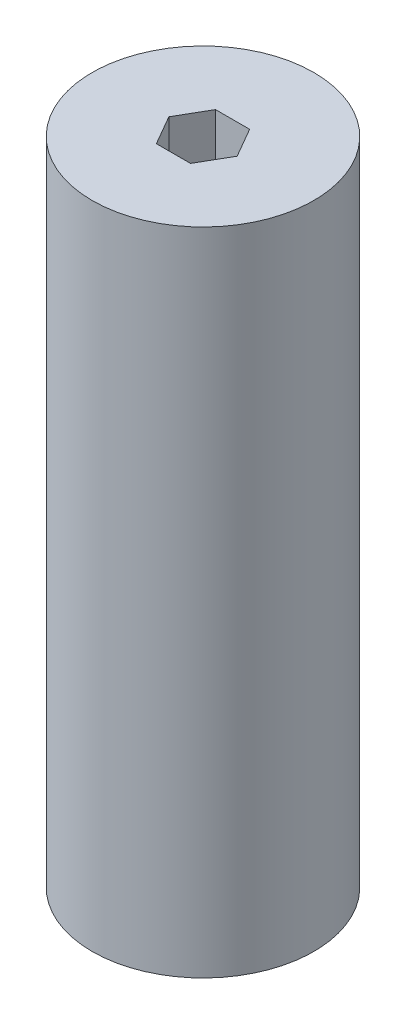
ISO-10303-21;
HEADER;
FILE_DESCRIPTION(('STEP AP214'),'2;1');
FILE_NAME('part.step','',(''),(''),'','','');
FILE_SCHEMA(('AUTOMOTIVE_DESIGN { 1 0 10303 214 1 1 1 1 }'));
ENDSEC;
DATA;
#1=APPLICATION_CONTEXT('core data for automotive mechanical design processes');
#2=APPLICATION_PROTOCOL_DEFINITION('international standard','automotive_design',2000,#1);
#3=PRODUCT_CONTEXT('',#1,'mechanical');
#4=PRODUCT('Part','Part','',(#3));
#5=PRODUCT_RELATED_PRODUCT_CATEGORY('part','',(#4));
#6=PRODUCT_DEFINITION_FORMATION('','',#4);
#7=PRODUCT_DEFINITION_CONTEXT('part definition',#1,'design');
#8=PRODUCT_DEFINITION('design','',#6,#7);
#9=PRODUCT_DEFINITION_SHAPE('','',#8);
#10=(LENGTH_UNIT() NAMED_UNIT(*) SI_UNIT(.MILLI.,.METRE.));
#11=(NAMED_UNIT(*) PLANE_ANGLE_UNIT() SI_UNIT($,.RADIAN.));
#12=(NAMED_UNIT(*) SI_UNIT($,.STERADIAN.) SOLID_ANGLE_UNIT());
#13=UNCERTAINTY_MEASURE_WITH_UNIT(LENGTH_MEASURE(1.E-05),#10,'distance_accuracy_value','');
#14=(GEOMETRIC_REPRESENTATION_CONTEXT(3) GLOBAL_UNCERTAINTY_ASSIGNED_CONTEXT((#13)) GLOBAL_UNIT_ASSIGNED_CONTEXT((#10,
#11,#12)) REPRESENTATION_CONTEXT('',''));
#15=CARTESIAN_POINT('',(0.,0.,0.));
#16=DIRECTION('',(0.,0.,1.));
#17=DIRECTION('',(1.,0.,0.));
#18=AXIS2_PLACEMENT_3D('',#15,#16,#17);
#19=CARTESIAN_POINT('',(0.,139.7,0.));
#20=DIRECTION('',(0.,1.,0.));
#21=DIRECTION('',(0.,0.,1.));
#22=AXIS2_PLACEMENT_3D('',#19,#20,#21);
#23=PLANE('',#22);
#24=CARTESIAN_POINT('',(0.,139.7,0.));
#25=DIRECTION('',(0.,1.,0.));
#26=DIRECTION('',(0.,0.,1.));
#27=AXIS2_PLACEMENT_3D('',#24,#25,#26);
#28=CIRCLE('',#27,23.8125);
#29=CARTESIAN_POINT('',(0.,139.7,23.8125));
#30=VERTEX_POINT('',#29);
#31=EDGE_CURVE('E11',#30,#30,#28,.T.);
#32=ORIENTED_EDGE('',*,*,#31,.T.);
#33=EDGE_LOOP('',(#32));
#34=FACE_BOUND('',#33,.T.);
#35=DIRECTION('',(0.5,0.,-0.866025403784438));
#36=VECTOR('',#35,1.);
#37=CARTESIAN_POINT('',(3.66617420935412,139.7,6.35));
#38=LINE('',#37,#36);
#39=CARTESIAN_POINT('',(3.66617420935412,139.7,6.35));
#40=VERTEX_POINT('',#39);
#41=CARTESIAN_POINT('',(7.33234841870825,139.7,0.));
#42=VERTEX_POINT('',#41);
#43=EDGE_CURVE('E96',#40,#42,#38,.T.);
#44=ORIENTED_EDGE('',*,*,#43,.F.);
#45=DIRECTION('',(1.,0.,0.));
#46=VECTOR('',#45,1.);
#47=CARTESIAN_POINT('',(-3.66617420935412,139.7,6.35));
#48=LINE('',#47,#46);
#49=CARTESIAN_POINT('',(-3.66617420935412,139.7,6.35));
#50=VERTEX_POINT('',#49);
#51=EDGE_CURVE('E88',#50,#40,#48,.T.);
#52=ORIENTED_EDGE('',*,*,#51,.F.);
#53=DIRECTION('',(0.5,0.,0.866025403784439));
#54=VECTOR('',#53,1.);
#55=CARTESIAN_POINT('',(-7.33234841870825,139.7,0.));
#56=LINE('',#55,#54);
#57=CARTESIAN_POINT('',(-7.33234841870825,139.7,0.));
#58=VERTEX_POINT('',#57);
#59=EDGE_CURVE('E116',#58,#50,#56,.T.);
#60=ORIENTED_EDGE('',*,*,#59,.F.);
#61=DIRECTION('',(-0.5,0.,0.866025403784438));
#62=VECTOR('',#61,1.);
#63=CARTESIAN_POINT('',(-3.66617420935412,139.7,-6.35));
#64=LINE('',#63,#62);
#65=CARTESIAN_POINT('',(-3.66617420935412,139.7,-6.35));
#66=VERTEX_POINT('',#65);
#67=EDGE_CURVE('E114',#66,#58,#64,.T.);
#68=ORIENTED_EDGE('',*,*,#67,.F.);
#69=DIRECTION('',(-1.,0.,0.));
#70=VECTOR('',#69,1.);
#71=CARTESIAN_POINT('',(3.66617420935412,139.7,-6.35));
#72=LINE('',#71,#70);
#73=CARTESIAN_POINT('',(3.66617420935412,139.7,-6.35));
#74=VERTEX_POINT('',#73);
#75=EDGE_CURVE('E110',#74,#66,#72,.T.);
#76=ORIENTED_EDGE('',*,*,#75,.F.);
#77=DIRECTION('',(-0.5,0.,-0.866025403784439));
#78=VECTOR('',#77,1.);
#79=CARTESIAN_POINT('',(7.33234841870825,139.7,0.));
#80=LINE('',#79,#78);
#81=EDGE_CURVE('E108',#42,#74,#80,.T.);
#82=ORIENTED_EDGE('',*,*,#81,.F.);
#83=EDGE_LOOP('',(#44,#52,#60,#68,#76,#82));
#84=FACE_BOUND('',#83,.T.);
#85=ADVANCED_FACE('F35',(#34,#84),#23,.T.);
#86=CARTESIAN_POINT('',(0.,0.,0.));
#87=DIRECTION('',(0.,1.,0.));
#88=DIRECTION('',(0.,0.,1.));
#89=AXIS2_PLACEMENT_3D('',#86,#87,#88);
#90=PLANE('',#89);
#91=CARTESIAN_POINT('',(0.,0.,0.));
#92=DIRECTION('',(0.,1.,0.));
#93=DIRECTION('',(0.,0.,1.));
#94=AXIS2_PLACEMENT_3D('',#91,#92,#93);
#95=CIRCLE('',#94,23.8125);
#96=CARTESIAN_POINT('',(0.,0.,23.8125));
#97=VERTEX_POINT('',#96);
#98=EDGE_CURVE('E39',#97,#97,#95,.T.);
#99=ORIENTED_EDGE('',*,*,#98,.F.);
#100=EDGE_LOOP('',(#99));
#101=FACE_BOUND('',#100,.T.);
#102=DIRECTION('',(1.,0.,0.));
#103=VECTOR('',#102,1.);
#104=CARTESIAN_POINT('',(-3.66617420935412,0.,6.35));
#105=LINE('',#104,#103);
#106=CARTESIAN_POINT('',(-3.66617420935412,0.,6.35));
#107=VERTEX_POINT('',#106);
#108=CARTESIAN_POINT('',(3.66617420935412,0.,6.35));
#109=VERTEX_POINT('',#108);
#110=EDGE_CURVE('E58',#107,#109,#105,.T.);
#111=ORIENTED_EDGE('',*,*,#110,.T.);
#112=DIRECTION('',(0.5,0.,-0.866025403784438));
#113=VECTOR('',#112,1.);
#114=CARTESIAN_POINT('',(3.66617420935412,0.,6.35));
#115=LINE('',#114,#113);
#116=CARTESIAN_POINT('',(7.33234841870825,0.,0.));
#117=VERTEX_POINT('',#116);
#118=EDGE_CURVE('E103',#109,#117,#115,.T.);
#119=ORIENTED_EDGE('',*,*,#118,.T.);
#120=DIRECTION('',(-0.5,0.,-0.866025403784439));
#121=VECTOR('',#120,1.);
#122=CARTESIAN_POINT('',(7.33234841870825,0.,0.));
#123=LINE('',#122,#121);
#124=CARTESIAN_POINT('',(3.66617420935412,0.,-6.35));
#125=VERTEX_POINT('',#124);
#126=EDGE_CURVE('E120',#117,#125,#123,.T.);
#127=ORIENTED_EDGE('',*,*,#126,.T.);
#128=DIRECTION('',(-1.,0.,0.));
#129=VECTOR('',#128,1.);
#130=CARTESIAN_POINT('',(3.66617420935412,0.,-6.35));
#131=LINE('',#130,#129);
#132=CARTESIAN_POINT('',(-3.66617420935412,0.,-6.35));
#133=VERTEX_POINT('',#132);
#134=EDGE_CURVE('E123',#125,#133,#131,.T.);
#135=ORIENTED_EDGE('',*,*,#134,.T.);
#136=DIRECTION('',(-0.5,0.,0.866025403784438));
#137=VECTOR('',#136,1.);
#138=CARTESIAN_POINT('',(-3.66617420935412,0.,-6.35));
#139=LINE('',#138,#137);
#140=CARTESIAN_POINT('',(-7.33234841870825,0.,0.));
#141=VERTEX_POINT('',#140);
#142=EDGE_CURVE('E126',#133,#141,#139,.T.);
#143=ORIENTED_EDGE('',*,*,#142,.T.);
#144=DIRECTION('',(0.5,0.,0.866025403784439));
#145=VECTOR('',#144,1.);
#146=CARTESIAN_POINT('',(-7.33234841870825,0.,0.));
#147=LINE('',#146,#145);
#148=EDGE_CURVE('E97',#141,#107,#147,.T.);
#149=ORIENTED_EDGE('',*,*,#148,.T.);
#150=EDGE_LOOP('',(#111,#119,#127,#135,#143,#149));
#151=FACE_BOUND('',#150,.T.);
#152=ADVANCED_FACE('F143',(#101,#151),#90,.F.);
#153=CARTESIAN_POINT('',(0.,139.7,0.));
#154=DIRECTION('',(0.,-1.,0.));
#155=DIRECTION('',(0.,0.,-1.));
#156=AXIS2_PLACEMENT_3D('',#153,#154,#155);
#157=CYLINDRICAL_SURFACE('',#156,23.8125);
#158=ORIENTED_EDGE('',*,*,#31,.F.);
#159=EDGE_LOOP('',(#158));
#160=FACE_BOUND('',#159,.T.);
#161=ORIENTED_EDGE('',*,*,#98,.T.);
#162=EDGE_LOOP('',(#161));
#163=FACE_BOUND('',#162,.T.);
#164=ADVANCED_FACE('F37',(#160,#163),#157,.T.);
#165=CARTESIAN_POINT('',(-3.66617420935412,139.7,6.35));
#166=DIRECTION('',(0.,0.,-1.));
#167=DIRECTION('',(-1.,0.,0.));
#168=AXIS2_PLACEMENT_3D('',#165,#166,#167);
#169=PLANE('',#168);
#170=ORIENTED_EDGE('',*,*,#110,.F.);
#171=DIRECTION('',(0.,-1.,0.));
#172=VECTOR('',#171,1.);
#173=CARTESIAN_POINT('',(-3.66617420935412,139.7,6.35));
#174=LINE('',#173,#172);
#175=EDGE_CURVE('E92',#50,#107,#174,.T.);
#176=ORIENTED_EDGE('',*,*,#175,.F.);
#177=ORIENTED_EDGE('',*,*,#51,.T.);
#178=DIRECTION('',(0.,-1.,0.));
#179=VECTOR('',#178,1.);
#180=CARTESIAN_POINT('',(3.66617420935412,139.7,6.35));
#181=LINE('',#180,#179);
#182=EDGE_CURVE('E91',#40,#109,#181,.T.);
#183=ORIENTED_EDGE('',*,*,#182,.T.);
#184=EDGE_LOOP('',(#170,#176,#177,#183));
#185=FACE_BOUND('',#184,.T.);
#186=ADVANCED_FACE('F90',(#185),#169,.T.);
#187=CARTESIAN_POINT('',(3.66617420935412,139.7,6.35));
#188=DIRECTION('',(-0.866025403784438,0.,-0.5));
#189=DIRECTION('',(-0.5,0.,0.866025403784438));
#190=AXIS2_PLACEMENT_3D('',#187,#188,#189);
#191=PLANE('',#190);
#192=ORIENTED_EDGE('',*,*,#118,.F.);
#193=ORIENTED_EDGE('',*,*,#182,.F.);
#194=ORIENTED_EDGE('',*,*,#43,.T.);
#195=DIRECTION('',(0.,-1.,0.));
#196=VECTOR('',#195,1.);
#197=CARTESIAN_POINT('',(7.33234841870825,139.7,0.));
#198=LINE('',#197,#196);
#199=EDGE_CURVE('E104',#42,#117,#198,.T.);
#200=ORIENTED_EDGE('',*,*,#199,.T.);
#201=EDGE_LOOP('',(#192,#193,#194,#200));
#202=FACE_BOUND('',#201,.T.);
#203=ADVANCED_FACE('F100',(#202),#191,.T.);
#204=CARTESIAN_POINT('',(7.33234841870825,139.7,0.));
#205=DIRECTION('',(-0.866025403784439,0.,0.5));
#206=DIRECTION('',(0.5,0.,0.866025403784439));
#207=AXIS2_PLACEMENT_3D('',#204,#205,#206);
#208=PLANE('',#207);
#209=ORIENTED_EDGE('',*,*,#126,.F.);
#210=ORIENTED_EDGE('',*,*,#199,.F.);
#211=ORIENTED_EDGE('',*,*,#81,.T.);
#212=DIRECTION('',(0.,-1.,0.));
#213=VECTOR('',#212,1.);
#214=CARTESIAN_POINT('',(3.66617420935412,139.7,-6.35));
#215=LINE('',#214,#213);
#216=EDGE_CURVE('E135',#74,#125,#215,.T.);
#217=ORIENTED_EDGE('',*,*,#216,.T.);
#218=EDGE_LOOP('',(#209,#210,#211,#217));
#219=FACE_BOUND('',#218,.T.);
#220=ADVANCED_FACE('F139',(#219),#208,.T.);
#221=CARTESIAN_POINT('',(3.66617420935412,139.7,-6.35));
#222=DIRECTION('',(0.,0.,1.));
#223=DIRECTION('',(1.,0.,0.));
#224=AXIS2_PLACEMENT_3D('',#221,#222,#223);
#225=PLANE('',#224);
#226=ORIENTED_EDGE('',*,*,#134,.F.);
#227=ORIENTED_EDGE('',*,*,#216,.F.);
#228=ORIENTED_EDGE('',*,*,#75,.T.);
#229=DIRECTION('',(0.,-1.,0.));
#230=VECTOR('',#229,1.);
#231=CARTESIAN_POINT('',(-3.66617420935412,139.7,-6.35));
#232=LINE('',#231,#230);
#233=EDGE_CURVE('E133',#66,#133,#232,.T.);
#234=ORIENTED_EDGE('',*,*,#233,.T.);
#235=EDGE_LOOP('',(#226,#227,#228,#234));
#236=FACE_BOUND('',#235,.T.);
#237=ADVANCED_FACE('F151',(#236),#225,.T.);
#238=CARTESIAN_POINT('',(-3.66617420935412,139.7,-6.35));
#239=DIRECTION('',(0.866025403784438,0.,0.5));
#240=DIRECTION('',(0.5,0.,-0.866025403784438));
#241=AXIS2_PLACEMENT_3D('',#238,#239,#240);
#242=PLANE('',#241);
#243=ORIENTED_EDGE('',*,*,#142,.F.);
#244=ORIENTED_EDGE('',*,*,#233,.F.);
#245=ORIENTED_EDGE('',*,*,#67,.T.);
#246=DIRECTION('',(0.,-1.,0.));
#247=VECTOR('',#246,1.);
#248=CARTESIAN_POINT('',(-7.33234841870825,139.7,0.));
#249=LINE('',#248,#247);
#250=EDGE_CURVE('E50',#58,#141,#249,.T.);
#251=ORIENTED_EDGE('',*,*,#250,.T.);
#252=EDGE_LOOP('',(#243,#244,#245,#251));
#253=FACE_BOUND('',#252,.T.);
#254=ADVANCED_FACE('F149',(#253),#242,.T.);
#255=CARTESIAN_POINT('',(-7.33234841870825,139.7,0.));
#256=DIRECTION('',(0.866025403784439,0.,-0.5));
#257=DIRECTION('',(-0.5,0.,-0.866025403784439));
#258=AXIS2_PLACEMENT_3D('',#255,#256,#257);
#259=PLANE('',#258);
#260=ORIENTED_EDGE('',*,*,#148,.F.);
#261=ORIENTED_EDGE('',*,*,#250,.F.);
#262=ORIENTED_EDGE('',*,*,#59,.T.);
#263=ORIENTED_EDGE('',*,*,#175,.T.);
#264=EDGE_LOOP('',(#260,#261,#262,#263));
#265=FACE_BOUND('',#264,.T.);
#266=ADVANCED_FACE('F145',(#265),#259,.T.);
#267=CLOSED_SHELL('',(#85,#152,#164,#186,#203,#220,#237,#254,#266));
#268=MANIFOLD_SOLID_BREP('B2',#267);
#269=ADVANCED_BREP_SHAPE_REPRESENTATION('',(#18,#268),#14);
#270=SHAPE_DEFINITION_REPRESENTATION(#9,#269);
ENDSEC;
END-ISO-10303-21;
